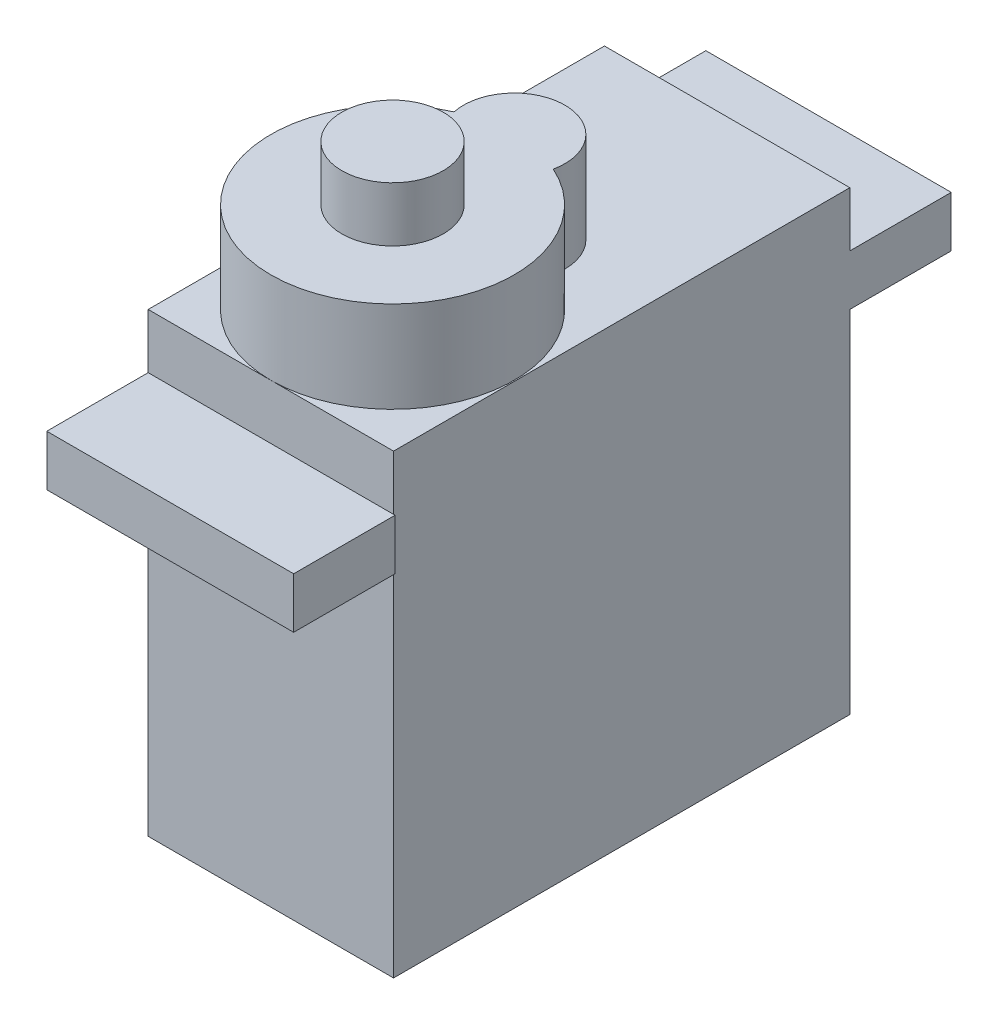
ISO-10303-21;
HEADER;
FILE_DESCRIPTION(('STEP AP214'),'2;1');
FILE_NAME('part.step','',(''),(''),'','','');
FILE_SCHEMA(('AUTOMOTIVE_DESIGN { 1 0 10303 214 1 1 1 1 }'));
ENDSEC;
DATA;
#1=APPLICATION_CONTEXT('core data for automotive mechanical design processes');
#2=APPLICATION_PROTOCOL_DEFINITION('international standard','automotive_design',2000,#1);
#3=PRODUCT_CONTEXT('',#1,'mechanical');
#4=PRODUCT('Part','Part','',(#3));
#5=PRODUCT_RELATED_PRODUCT_CATEGORY('part','',(#4));
#6=PRODUCT_DEFINITION_FORMATION('','',#4);
#7=PRODUCT_DEFINITION_CONTEXT('part definition',#1,'design');
#8=PRODUCT_DEFINITION('design','',#6,#7);
#9=PRODUCT_DEFINITION_SHAPE('','',#8);
#10=(LENGTH_UNIT() NAMED_UNIT(*) SI_UNIT(.MILLI.,.METRE.));
#11=(NAMED_UNIT(*) PLANE_ANGLE_UNIT() SI_UNIT($,.RADIAN.));
#12=(NAMED_UNIT(*) SI_UNIT($,.STERADIAN.) SOLID_ANGLE_UNIT());
#13=UNCERTAINTY_MEASURE_WITH_UNIT(LENGTH_MEASURE(1.E-05),#10,'distance_accuracy_value','');
#14=(GEOMETRIC_REPRESENTATION_CONTEXT(3) GLOBAL_UNCERTAINTY_ASSIGNED_CONTEXT((#13)) GLOBAL_UNIT_ASSIGNED_CONTEXT((#10,
#11,#12)) REPRESENTATION_CONTEXT('',''));
#15=CARTESIAN_POINT('',(0.,0.,0.));
#16=DIRECTION('',(0.,0.,1.));
#17=DIRECTION('',(1.,0.,0.));
#18=AXIS2_PLACEMENT_3D('',#15,#16,#17);
#19=CARTESIAN_POINT('',(6.05,22.5,-11.25));
#20=DIRECTION('',(-1.,0.,0.));
#21=DIRECTION('',(0.,0.,1.));
#22=AXIS2_PLACEMENT_3D('',#19,#20,#21);
#23=PLANE('',#22);
#24=DIRECTION('',(0.,0.,-1.));
#25=VECTOR('',#24,1.);
#26=CARTESIAN_POINT('',(6.05,0.,-11.25));
#27=LINE('',#26,#25);
#28=CARTESIAN_POINT('',(6.05,0.,11.25));
#29=VERTEX_POINT('',#28);
#30=CARTESIAN_POINT('',(6.05,0.,-11.25));
#31=VERTEX_POINT('',#30);
#32=EDGE_CURVE('E199',#29,#31,#27,.T.);
#33=ORIENTED_EDGE('',*,*,#32,.T.);
#34=DIRECTION('',(0.,-1.,0.));
#35=VECTOR('',#34,1.);
#36=CARTESIAN_POINT('',(6.05,17.3,-11.25));
#37=LINE('',#36,#35);
#38=CARTESIAN_POINT('',(6.05,17.3,-11.25));
#39=VERTEX_POINT('',#38);
#40=EDGE_CURVE('E294',#39,#31,#37,.T.);
#41=ORIENTED_EDGE('',*,*,#40,.F.);
#42=DIRECTION('',(0.,0.,1.));
#43=VECTOR('',#42,1.);
#44=CARTESIAN_POINT('',(6.05,17.3,-11.25));
#45=LINE('',#44,#43);
#46=CARTESIAN_POINT('',(6.05,17.3,-16.25));
#47=VERTEX_POINT('',#46);
#48=EDGE_CURVE('E290',#47,#39,#45,.T.);
#49=ORIENTED_EDGE('',*,*,#48,.F.);
#50=DIRECTION('',(0.,-1.,0.));
#51=VECTOR('',#50,1.);
#52=CARTESIAN_POINT('',(6.05,19.8,-16.25));
#53=LINE('',#52,#51);
#54=CARTESIAN_POINT('',(6.05,19.8,-16.25));
#55=VERTEX_POINT('',#54);
#56=EDGE_CURVE('E237',#55,#47,#53,.T.);
#57=ORIENTED_EDGE('',*,*,#56,.F.);
#58=DIRECTION('',(0.,0.,1.));
#59=VECTOR('',#58,1.);
#60=CARTESIAN_POINT('',(6.05,19.8,-11.25));
#61=LINE('',#60,#59);
#62=CARTESIAN_POINT('',(6.05,19.8,-11.25));
#63=VERTEX_POINT('',#62);
#64=EDGE_CURVE('E234',#55,#63,#61,.T.);
#65=ORIENTED_EDGE('',*,*,#64,.T.);
#66=DIRECTION('',(0.,-1.,0.));
#67=VECTOR('',#66,1.);
#68=CARTESIAN_POINT('',(6.05,22.5,-11.25));
#69=LINE('',#68,#67);
#70=CARTESIAN_POINT('',(6.05,22.5,-11.25));
#71=VERTEX_POINT('',#70);
#72=EDGE_CURVE('E43',#71,#63,#69,.T.);
#73=ORIENTED_EDGE('',*,*,#72,.F.);
#74=DIRECTION('',(0.,0.,-1.));
#75=VECTOR('',#74,1.);
#76=CARTESIAN_POINT('',(6.05,22.5,-11.25));
#77=LINE('',#76,#75);
#78=CARTESIAN_POINT('',(6.05,22.5,11.25));
#79=VERTEX_POINT('',#78);
#80=EDGE_CURVE('E200',#79,#71,#77,.T.);
#81=ORIENTED_EDGE('',*,*,#80,.F.);
#82=DIRECTION('',(0.,-1.,0.));
#83=VECTOR('',#82,1.);
#84=CARTESIAN_POINT('',(6.05,22.5,11.25));
#85=LINE('',#84,#83);
#86=CARTESIAN_POINT('',(6.05,19.8,11.25));
#87=VERTEX_POINT('',#86);
#88=EDGE_CURVE('E212',#79,#87,#85,.T.);
#89=ORIENTED_EDGE('',*,*,#88,.T.);
#90=DIRECTION('',(0.,-1.,0.));
#91=VECTOR('',#90,1.);
#92=CARTESIAN_POINT('',(6.05,22.5,11.25));
#93=LINE('',#92,#91);
#94=CARTESIAN_POINT('',(6.05,17.3,11.25));
#95=VERTEX_POINT('',#94);
#96=EDGE_CURVE('E173',#87,#95,#93,.T.);
#97=ORIENTED_EDGE('',*,*,#96,.T.);
#98=DIRECTION('',(0.,-1.,0.));
#99=VECTOR('',#98,1.);
#100=CARTESIAN_POINT('',(6.05,22.5,11.25));
#101=LINE('',#100,#99);
#102=EDGE_CURVE('E285',#95,#29,#101,.T.);
#103=ORIENTED_EDGE('',*,*,#102,.T.);
#104=EDGE_LOOP('',(#33,#41,#49,#57,#65,#73,#81,#89,#97,#103));
#105=FACE_BOUND('',#104,.T.);
#106=ADVANCED_FACE('F35',(#105),#23,.F.);
#107=CARTESIAN_POINT('',(-6.05,22.5,-11.25));
#108=DIRECTION('',(0.,0.,1.));
#109=DIRECTION('',(1.,0.,0.));
#110=AXIS2_PLACEMENT_3D('',#107,#108,#109);
#111=PLANE('',#110);
#112=ORIENTED_EDGE('',*,*,#72,.T.);
#113=DIRECTION('',(-1.,0.,0.));
#114=VECTOR('',#113,1.);
#115=CARTESIAN_POINT('',(-6.05,19.8,-11.25));
#116=LINE('',#115,#114);
#117=CARTESIAN_POINT('',(-6.05,19.8,-11.25));
#118=VERTEX_POINT('',#117);
#119=EDGE_CURVE('E230',#63,#118,#116,.T.);
#120=ORIENTED_EDGE('',*,*,#119,.T.);
#121=DIRECTION('',(0.,-1.,0.));
#122=VECTOR('',#121,1.);
#123=CARTESIAN_POINT('',(-6.05,22.5,-11.25));
#124=LINE('',#123,#122);
#125=CARTESIAN_POINT('',(-6.05,22.5,-11.25));
#126=VERTEX_POINT('',#125);
#127=EDGE_CURVE('E221',#126,#118,#124,.T.);
#128=ORIENTED_EDGE('',*,*,#127,.F.);
#129=DIRECTION('',(-1.,0.,0.));
#130=VECTOR('',#129,1.);
#131=CARTESIAN_POINT('',(-6.05,22.5,-11.25));
#132=LINE('',#131,#130);
#133=EDGE_CURVE('E203',#71,#126,#132,.T.);
#134=ORIENTED_EDGE('',*,*,#133,.F.);
#135=EDGE_LOOP('',(#112,#120,#128,#134));
#136=FACE_BOUND('',#135,.T.);
#137=ADVANCED_FACE('F227',(#136),#111,.F.);
#138=CARTESIAN_POINT('',(-6.05,22.5,-11.25));
#139=DIRECTION('',(1.,0.,0.));
#140=DIRECTION('',(0.,0.,-1.));
#141=AXIS2_PLACEMENT_3D('',#138,#139,#140);
#142=PLANE('',#141);
#143=DIRECTION('',(0.,0.,1.));
#144=VECTOR('',#143,1.);
#145=CARTESIAN_POINT('',(-6.05,0.,-11.25));
#146=LINE('',#145,#144);
#147=CARTESIAN_POINT('',(-6.05,0.,-11.25));
#148=VERTEX_POINT('',#147);
#149=CARTESIAN_POINT('',(-6.05,0.,11.25));
#150=VERTEX_POINT('',#149);
#151=EDGE_CURVE('E204',#148,#150,#146,.T.);
#152=ORIENTED_EDGE('',*,*,#151,.T.);
#153=DIRECTION('',(0.,-1.,0.));
#154=VECTOR('',#153,1.);
#155=CARTESIAN_POINT('',(-6.05,17.3,11.25));
#156=LINE('',#155,#154);
#157=CARTESIAN_POINT('',(-6.05,17.3,11.25));
#158=VERTEX_POINT('',#157);
#159=EDGE_CURVE('E282',#158,#150,#156,.T.);
#160=ORIENTED_EDGE('',*,*,#159,.F.);
#161=DIRECTION('',(0.,0.,-1.));
#162=VECTOR('',#161,1.);
#163=CARTESIAN_POINT('',(-6.05,17.3,11.25));
#164=LINE('',#163,#162);
#165=CARTESIAN_POINT('',(-6.05,17.3,16.25));
#166=VERTEX_POINT('',#165);
#167=EDGE_CURVE('E165',#166,#158,#164,.T.);
#168=ORIENTED_EDGE('',*,*,#167,.F.);
#169=DIRECTION('',(0.,-1.,0.));
#170=VECTOR('',#169,1.);
#171=CARTESIAN_POINT('',(-6.05,19.8,16.25));
#172=LINE('',#171,#170);
#173=CARTESIAN_POINT('',(-6.05,19.8,16.25));
#174=VERTEX_POINT('',#173);
#175=EDGE_CURVE('E164',#174,#166,#172,.T.);
#176=ORIENTED_EDGE('',*,*,#175,.F.);
#177=DIRECTION('',(0.,0.,-1.));
#178=VECTOR('',#177,1.);
#179=CARTESIAN_POINT('',(-6.05,19.8,11.25));
#180=LINE('',#179,#178);
#181=CARTESIAN_POINT('',(-6.05,19.8,11.25));
#182=VERTEX_POINT('',#181);
#183=EDGE_CURVE('E175',#174,#182,#180,.T.);
#184=ORIENTED_EDGE('',*,*,#183,.T.);
#185=DIRECTION('',(0.,-1.,0.));
#186=VECTOR('',#185,1.);
#187=CARTESIAN_POINT('',(-6.05,22.5,11.25));
#188=LINE('',#187,#186);
#189=CARTESIAN_POINT('',(-6.05,22.5,11.25));
#190=VERTEX_POINT('',#189);
#191=EDGE_CURVE('E219',#190,#182,#188,.T.);
#192=ORIENTED_EDGE('',*,*,#191,.F.);
#193=DIRECTION('',(0.,0.,1.));
#194=VECTOR('',#193,1.);
#195=CARTESIAN_POINT('',(-6.05,22.5,-11.25));
#196=LINE('',#195,#194);
#197=EDGE_CURVE('E206',#126,#190,#196,.T.);
#198=ORIENTED_EDGE('',*,*,#197,.F.);
#199=ORIENTED_EDGE('',*,*,#127,.T.);
#200=DIRECTION('',(0.,0.,-1.));
#201=VECTOR('',#200,1.);
#202=CARTESIAN_POINT('',(-6.05,19.8,-16.25));
#203=LINE('',#202,#201);
#204=CARTESIAN_POINT('',(-6.05,19.8,-16.25));
#205=VERTEX_POINT('',#204);
#206=EDGE_CURVE('E245',#118,#205,#203,.T.);
#207=ORIENTED_EDGE('',*,*,#206,.T.);
#208=DIRECTION('',(0.,-1.,0.));
#209=VECTOR('',#208,1.);
#210=CARTESIAN_POINT('',(-6.05,19.8,-16.25));
#211=LINE('',#210,#209);
#212=CARTESIAN_POINT('',(-6.05,17.3,-16.25));
#213=VERTEX_POINT('',#212);
#214=EDGE_CURVE('E246',#205,#213,#211,.T.);
#215=ORIENTED_EDGE('',*,*,#214,.T.);
#216=DIRECTION('',(0.,0.,-1.));
#217=VECTOR('',#216,1.);
#218=CARTESIAN_POINT('',(-6.05,17.3,-16.25));
#219=LINE('',#218,#217);
#220=CARTESIAN_POINT('',(-6.05,17.3,-11.25));
#221=VERTEX_POINT('',#220);
#222=EDGE_CURVE('E60',#221,#213,#219,.T.);
#223=ORIENTED_EDGE('',*,*,#222,.F.);
#224=DIRECTION('',(0.,-1.,0.));
#225=VECTOR('',#224,1.);
#226=CARTESIAN_POINT('',(-6.05,17.3,-11.25));
#227=LINE('',#226,#225);
#228=EDGE_CURVE('E279',#221,#148,#227,.T.);
#229=ORIENTED_EDGE('',*,*,#228,.T.);
#230=EDGE_LOOP('',(#152,#160,#168,#176,#184,#192,#198,#199,#207,#215,#223,#229));
#231=FACE_BOUND('',#230,.T.);
#232=ADVANCED_FACE('F262',(#231),#142,.F.);
#233=CARTESIAN_POINT('',(-6.05,22.5,11.25));
#234=DIRECTION('',(0.,0.,-1.));
#235=DIRECTION('',(-1.,0.,0.));
#236=AXIS2_PLACEMENT_3D('',#233,#234,#235);
#237=PLANE('',#236);
#238=ORIENTED_EDGE('',*,*,#191,.T.);
#239=DIRECTION('',(1.,0.,0.));
#240=VECTOR('',#239,1.);
#241=CARTESIAN_POINT('',(6.125,19.8,11.25));
#242=LINE('',#241,#240);
#243=EDGE_CURVE('E254',#182,#87,#242,.T.);
#244=ORIENTED_EDGE('',*,*,#243,.T.);
#245=ORIENTED_EDGE('',*,*,#88,.F.);
#246=DIRECTION('',(1.,0.,0.));
#247=VECTOR('',#246,1.);
#248=CARTESIAN_POINT('',(-6.05,22.5,11.25));
#249=LINE('',#248,#247);
#250=CARTESIAN_POINT('',(0.,22.5,11.25));
#251=VERTEX_POINT('',#250);
#252=EDGE_CURVE('E208',#251,#79,#249,.T.);
#253=ORIENTED_EDGE('',*,*,#252,.F.);
#254=EDGE_CURVE('E209',#190,#251,#249,.T.);
#255=ORIENTED_EDGE('',*,*,#254,.F.);
#256=EDGE_LOOP('',(#238,#244,#245,#253,#255));
#257=FACE_BOUND('',#256,.T.);
#258=ADVANCED_FACE('F271',(#257),#237,.F.);
#259=CARTESIAN_POINT('',(0.,22.5,0.));
#260=DIRECTION('',(0.,1.,0.));
#261=DIRECTION('',(0.,0.,1.));
#262=AXIS2_PLACEMENT_3D('',#259,#260,#261);
#263=PLANE('',#262);
#264=CARTESIAN_POINT('',(0.,22.5,5.25));
#265=DIRECTION('',(0.,1.,0.));
#266=DIRECTION('',(0.,0.,1.));
#267=AXIS2_PLACEMENT_3D('',#264,#265,#266);
#268=CIRCLE('',#267,6.);
#269=CARTESIAN_POINT('',(-2.44514470714698,22.5,-0.229166666666664));
#270=VERTEX_POINT('',#269);
#271=EDGE_CURVE('E45',#270,#251,#268,.T.);
#272=ORIENTED_EDGE('',*,*,#271,.F.);
#273=CARTESIAN_POINT('',(0.,22.5,-0.749999999999998));
#274=DIRECTION('',(0.,1.,0.));
#275=DIRECTION('',(0.,0.,1.));
#276=AXIS2_PLACEMENT_3D('',#273,#274,#275);
#277=CIRCLE('',#276,2.5);
#278=CARTESIAN_POINT('',(2.44514470714698,22.5,-0.229166666666663));
#279=VERTEX_POINT('',#278);
#280=EDGE_CURVE('E188',#279,#270,#277,.T.);
#281=ORIENTED_EDGE('',*,*,#280,.F.);
#282=EDGE_CURVE('E11',#251,#279,#268,.T.);
#283=ORIENTED_EDGE('',*,*,#282,.F.);
#284=ORIENTED_EDGE('',*,*,#252,.T.);
#285=ORIENTED_EDGE('',*,*,#80,.T.);
#286=ORIENTED_EDGE('',*,*,#133,.T.);
#287=ORIENTED_EDGE('',*,*,#197,.T.);
#288=ORIENTED_EDGE('',*,*,#254,.T.);
#289=EDGE_LOOP('',(#272,#281,#283,#284,#285,#286,#287,#288));
#290=FACE_BOUND('',#289,.T.);
#291=ADVANCED_FACE('F303',(#290),#263,.T.);
#292=CARTESIAN_POINT('',(0.,0.,0.));
#293=DIRECTION('',(0.,1.,0.));
#294=DIRECTION('',(0.,0.,1.));
#295=AXIS2_PLACEMENT_3D('',#292,#293,#294);
#296=PLANE('',#295);
#297=ORIENTED_EDGE('',*,*,#32,.F.);
#298=DIRECTION('',(1.,0.,0.));
#299=VECTOR('',#298,1.);
#300=CARTESIAN_POINT('',(6.125,0.,11.25));
#301=LINE('',#300,#299);
#302=EDGE_CURVE('E277',#150,#29,#301,.T.);
#303=ORIENTED_EDGE('',*,*,#302,.F.);
#304=ORIENTED_EDGE('',*,*,#151,.F.);
#305=DIRECTION('',(-1.,0.,0.));
#306=VECTOR('',#305,1.);
#307=CARTESIAN_POINT('',(-6.05,0.,-11.25));
#308=LINE('',#307,#306);
#309=EDGE_CURVE('E288',#31,#148,#308,.T.);
#310=ORIENTED_EDGE('',*,*,#309,.F.);
#311=EDGE_LOOP('',(#297,#303,#304,#310));
#312=FACE_BOUND('',#311,.T.);
#313=ADVANCED_FACE('F337',(#312),#296,.F.);
#314=CARTESIAN_POINT('',(0.,27.,5.25));
#315=DIRECTION('',(0.,-1.,0.));
#316=DIRECTION('',(0.,0.,-1.));
#317=AXIS2_PLACEMENT_3D('',#314,#315,#316);
#318=CYLINDRICAL_SURFACE('',#317,6.);
#319=ORIENTED_EDGE('',*,*,#271,.T.);
#320=ORIENTED_EDGE('',*,*,#282,.T.);
#321=DIRECTION('',(0.,-1.,0.));
#322=VECTOR('',#321,1.);
#323=CARTESIAN_POINT('',(2.44514470714698,27.,-0.229166666666663));
#324=LINE('',#323,#322);
#325=CARTESIAN_POINT('',(2.44514470714698,27.,-0.229166666666663));
#326=VERTEX_POINT('',#325);
#327=EDGE_CURVE('E196',#326,#279,#324,.T.);
#328=ORIENTED_EDGE('',*,*,#327,.F.);
#329=CARTESIAN_POINT('',(0.,27.,5.25));
#330=DIRECTION('',(0.,1.,0.));
#331=DIRECTION('',(0.,0.,1.));
#332=AXIS2_PLACEMENT_3D('',#329,#330,#331);
#333=CIRCLE('',#332,6.);
#334=CARTESIAN_POINT('',(-2.44514470714698,27.,-0.229166666666664));
#335=VERTEX_POINT('',#334);
#336=EDGE_CURVE('E184',#335,#326,#333,.T.);
#337=ORIENTED_EDGE('',*,*,#336,.F.);
#338=DIRECTION('',(0.,-1.,0.));
#339=VECTOR('',#338,1.);
#340=CARTESIAN_POINT('',(-2.44514470714698,27.,-0.229166666666664));
#341=LINE('',#340,#339);
#342=EDGE_CURVE('E189',#335,#270,#341,.T.);
#343=ORIENTED_EDGE('',*,*,#342,.T.);
#344=EDGE_LOOP('',(#319,#320,#328,#337,#343));
#345=FACE_BOUND('',#344,.T.);
#346=ADVANCED_FACE('F306',(#345),#318,.T.);
#347=CARTESIAN_POINT('',(0.,27.,-0.749999999999998));
#348=DIRECTION('',(0.,-1.,0.));
#349=DIRECTION('',(0.,0.,-1.));
#350=AXIS2_PLACEMENT_3D('',#347,#348,#349);
#351=CYLINDRICAL_SURFACE('',#350,2.5);
#352=ORIENTED_EDGE('',*,*,#280,.T.);
#353=ORIENTED_EDGE('',*,*,#342,.F.);
#354=CARTESIAN_POINT('',(0.,27.,-0.749999999999998));
#355=DIRECTION('',(0.,1.,0.));
#356=DIRECTION('',(0.,0.,1.));
#357=AXIS2_PLACEMENT_3D('',#354,#355,#356);
#358=CIRCLE('',#357,2.5);
#359=EDGE_CURVE('E187',#326,#335,#358,.T.);
#360=ORIENTED_EDGE('',*,*,#359,.F.);
#361=ORIENTED_EDGE('',*,*,#327,.T.);
#362=EDGE_LOOP('',(#352,#353,#360,#361));
#363=FACE_BOUND('',#362,.T.);
#364=ADVANCED_FACE('F309',(#363),#351,.T.);
#365=CARTESIAN_POINT('',(0.,27.,2.25));
#366=DIRECTION('',(0.,1.,0.));
#367=DIRECTION('',(0.,0.,1.));
#368=AXIS2_PLACEMENT_3D('',#365,#366,#367);
#369=PLANE('',#368);
#370=CARTESIAN_POINT('',(0.,27.,5.25));
#371=DIRECTION('',(0.,1.,0.));
#372=DIRECTION('',(0.,0.,1.));
#373=AXIS2_PLACEMENT_3D('',#370,#371,#372);
#374=CIRCLE('',#373,2.5);
#375=CARTESIAN_POINT('',(0.,27.,7.75));
#376=VERTEX_POINT('',#375);
#377=EDGE_CURVE('E38',#376,#376,#374,.F.);
#378=ORIENTED_EDGE('',*,*,#377,.T.);
#379=EDGE_LOOP('',(#378));
#380=FACE_BOUND('',#379,.T.);
#381=ORIENTED_EDGE('',*,*,#336,.T.);
#382=ORIENTED_EDGE('',*,*,#359,.T.);
#383=EDGE_LOOP('',(#381,#382));
#384=FACE_BOUND('',#383,.T.);
#385=ADVANCED_FACE('F312',(#380,#384),#369,.T.);
#386=CARTESIAN_POINT('',(0.,29.7,5.25));
#387=DIRECTION('',(0.,-1.,0.));
#388=DIRECTION('',(0.,0.,-1.));
#389=AXIS2_PLACEMENT_3D('',#386,#387,#388);
#390=CYLINDRICAL_SURFACE('',#389,2.5);
#391=ORIENTED_EDGE('',*,*,#377,.F.);
#392=EDGE_LOOP('',(#391));
#393=FACE_BOUND('',#392,.T.);
#394=CARTESIAN_POINT('',(0.,29.7,5.25));
#395=DIRECTION('',(0.,1.,0.));
#396=DIRECTION('',(0.,0.,1.));
#397=AXIS2_PLACEMENT_3D('',#394,#395,#396);
#398=CIRCLE('',#397,2.5);
#399=CARTESIAN_POINT('',(0.,29.7,7.75));
#400=VERTEX_POINT('',#399);
#401=EDGE_CURVE('E181',#400,#400,#398,.T.);
#402=ORIENTED_EDGE('',*,*,#401,.F.);
#403=EDGE_LOOP('',(#402));
#404=FACE_BOUND('',#403,.T.);
#405=ADVANCED_FACE('F314',(#393,#404),#390,.T.);
#406=CARTESIAN_POINT('',(0.,29.7,5.25));
#407=DIRECTION('',(0.,1.,0.));
#408=DIRECTION('',(0.,0.,1.));
#409=AXIS2_PLACEMENT_3D('',#406,#407,#408);
#410=PLANE('',#409);
#411=ORIENTED_EDGE('',*,*,#401,.T.);
#412=EDGE_LOOP('',(#411));
#413=FACE_BOUND('',#412,.T.);
#414=ADVANCED_FACE('F321',(#413),#410,.T.);
#415=CARTESIAN_POINT('',(6.125,19.8,11.25));
#416=DIRECTION('',(0.,0.,-1.));
#417=DIRECTION('',(-1.,0.,0.));
#418=AXIS2_PLACEMENT_3D('',#415,#416,#417);
#419=PLANE('',#418);
#420=DIRECTION('',(1.,0.,0.));
#421=VECTOR('',#420,1.);
#422=CARTESIAN_POINT('',(6.125,17.3,11.25));
#423=LINE('',#422,#421);
#424=CARTESIAN_POINT('',(6.125,17.3,11.25));
#425=VERTEX_POINT('',#424);
#426=EDGE_CURVE('E52',#95,#425,#423,.T.);
#427=ORIENTED_EDGE('',*,*,#426,.F.);
#428=ORIENTED_EDGE('',*,*,#96,.F.);
#429=CARTESIAN_POINT('',(6.125,19.8,11.25));
#430=VERTEX_POINT('',#429);
#431=EDGE_CURVE('E252',#87,#430,#242,.T.);
#432=ORIENTED_EDGE('',*,*,#431,.T.);
#433=DIRECTION('',(0.,-1.,0.));
#434=VECTOR('',#433,1.);
#435=CARTESIAN_POINT('',(6.125,19.8,11.25));
#436=LINE('',#435,#434);
#437=EDGE_CURVE('E171',#430,#425,#436,.T.);
#438=ORIENTED_EDGE('',*,*,#437,.T.);
#439=EDGE_LOOP('',(#427,#428,#432,#438));
#440=FACE_BOUND('',#439,.T.);
#441=ADVANCED_FACE('F276',(#440),#419,.T.);
#442=CARTESIAN_POINT('',(-6.05,19.8,16.25));
#443=DIRECTION('',(0.,0.,1.));
#444=DIRECTION('',(1.,0.,0.));
#445=AXIS2_PLACEMENT_3D('',#442,#443,#444);
#446=PLANE('',#445);
#447=DIRECTION('',(-1.,0.,0.));
#448=VECTOR('',#447,1.);
#449=CARTESIAN_POINT('',(-6.05,17.3,16.25));
#450=LINE('',#449,#448);
#451=CARTESIAN_POINT('',(6.125,17.3,16.25));
#452=VERTEX_POINT('',#451);
#453=EDGE_CURVE('E150',#452,#166,#450,.T.);
#454=ORIENTED_EDGE('',*,*,#453,.F.);
#455=DIRECTION('',(0.,-1.,0.));
#456=VECTOR('',#455,1.);
#457=CARTESIAN_POINT('',(6.125,19.8,16.25));
#458=LINE('',#457,#456);
#459=CARTESIAN_POINT('',(6.125,19.8,16.25));
#460=VERTEX_POINT('',#459);
#461=EDGE_CURVE('E162',#460,#452,#458,.T.);
#462=ORIENTED_EDGE('',*,*,#461,.F.);
#463=DIRECTION('',(-1.,0.,0.));
#464=VECTOR('',#463,1.);
#465=CARTESIAN_POINT('',(-6.05,19.8,16.25));
#466=LINE('',#465,#464);
#467=EDGE_CURVE('E257',#460,#174,#466,.T.);
#468=ORIENTED_EDGE('',*,*,#467,.T.);
#469=ORIENTED_EDGE('',*,*,#175,.T.);
#470=EDGE_LOOP('',(#454,#462,#468,#469));
#471=FACE_BOUND('',#470,.T.);
#472=ADVANCED_FACE('F160',(#471),#446,.T.);
#473=CARTESIAN_POINT('',(6.125,19.8,16.25));
#474=DIRECTION('',(1.,0.,0.));
#475=DIRECTION('',(0.,0.,-1.));
#476=AXIS2_PLACEMENT_3D('',#473,#474,#475);
#477=PLANE('',#476);
#478=DIRECTION('',(0.,0.,1.));
#479=VECTOR('',#478,1.);
#480=CARTESIAN_POINT('',(6.125,17.3,16.25));
#481=LINE('',#480,#479);
#482=EDGE_CURVE('E146',#425,#452,#481,.T.);
#483=ORIENTED_EDGE('',*,*,#482,.F.);
#484=ORIENTED_EDGE('',*,*,#437,.F.);
#485=DIRECTION('',(0.,0.,1.));
#486=VECTOR('',#485,1.);
#487=CARTESIAN_POINT('',(6.125,19.8,16.25));
#488=LINE('',#487,#486);
#489=EDGE_CURVE('E170',#430,#460,#488,.T.);
#490=ORIENTED_EDGE('',*,*,#489,.T.);
#491=ORIENTED_EDGE('',*,*,#461,.T.);
#492=EDGE_LOOP('',(#483,#484,#490,#491));
#493=FACE_BOUND('',#492,.T.);
#494=ADVANCED_FACE('F168',(#493),#477,.T.);
#495=CARTESIAN_POINT('',(0.,19.8,0.));
#496=DIRECTION('',(0.,1.,0.));
#497=DIRECTION('',(0.,0.,1.));
#498=AXIS2_PLACEMENT_3D('',#495,#496,#497);
#499=PLANE('',#498);
#500=ORIENTED_EDGE('',*,*,#243,.F.);
#501=ORIENTED_EDGE('',*,*,#183,.F.);
#502=ORIENTED_EDGE('',*,*,#467,.F.);
#503=ORIENTED_EDGE('',*,*,#489,.F.);
#504=ORIENTED_EDGE('',*,*,#431,.F.);
#505=EDGE_LOOP('',(#500,#501,#502,#503,#504));
#506=FACE_BOUND('',#505,.T.);
#507=ADVANCED_FACE('F267',(#506),#499,.T.);
#508=CARTESIAN_POINT('',(6.05,19.8,-16.25));
#509=DIRECTION('',(0.,0.,-1.));
#510=DIRECTION('',(-1.,0.,0.));
#511=AXIS2_PLACEMENT_3D('',#508,#509,#510);
#512=PLANE('',#511);
#513=DIRECTION('',(1.,0.,0.));
#514=VECTOR('',#513,1.);
#515=CARTESIAN_POINT('',(6.05,17.3,-16.25));
#516=LINE('',#515,#514);
#517=EDGE_CURVE('E287',#213,#47,#516,.T.);
#518=ORIENTED_EDGE('',*,*,#517,.F.);
#519=ORIENTED_EDGE('',*,*,#214,.F.);
#520=DIRECTION('',(1.,0.,0.));
#521=VECTOR('',#520,1.);
#522=CARTESIAN_POINT('',(6.05,19.8,-16.25));
#523=LINE('',#522,#521);
#524=EDGE_CURVE('E241',#205,#55,#523,.T.);
#525=ORIENTED_EDGE('',*,*,#524,.T.);
#526=ORIENTED_EDGE('',*,*,#56,.T.);
#527=EDGE_LOOP('',(#518,#519,#525,#526));
#528=FACE_BOUND('',#527,.T.);
#529=ADVANCED_FACE('F301',(#528),#512,.T.);
#530=CARTESIAN_POINT('',(0.,19.8,0.));
#531=DIRECTION('',(0.,1.,0.));
#532=DIRECTION('',(0.,0.,1.));
#533=AXIS2_PLACEMENT_3D('',#530,#531,#532);
#534=PLANE('',#533);
#535=ORIENTED_EDGE('',*,*,#206,.F.);
#536=ORIENTED_EDGE('',*,*,#119,.F.);
#537=ORIENTED_EDGE('',*,*,#64,.F.);
#538=ORIENTED_EDGE('',*,*,#524,.F.);
#539=EDGE_LOOP('',(#535,#536,#537,#538));
#540=FACE_BOUND('',#539,.T.);
#541=ADVANCED_FACE('F243',(#540),#534,.T.);
#542=CARTESIAN_POINT('',(-6.05,17.3,-11.25));
#543=DIRECTION('',(0.,0.,1.));
#544=DIRECTION('',(1.,0.,0.));
#545=AXIS2_PLACEMENT_3D('',#542,#543,#544);
#546=PLANE('',#545);
#547=ORIENTED_EDGE('',*,*,#309,.T.);
#548=ORIENTED_EDGE('',*,*,#228,.F.);
#549=DIRECTION('',(-1.,0.,0.));
#550=VECTOR('',#549,1.);
#551=CARTESIAN_POINT('',(-6.05,17.3,-11.25));
#552=LINE('',#551,#550);
#553=EDGE_CURVE('E292',#39,#221,#552,.T.);
#554=ORIENTED_EDGE('',*,*,#553,.F.);
#555=ORIENTED_EDGE('',*,*,#40,.T.);
#556=EDGE_LOOP('',(#547,#548,#554,#555));
#557=FACE_BOUND('',#556,.T.);
#558=ADVANCED_FACE('F407',(#557),#546,.F.);
#559=CARTESIAN_POINT('',(0.,17.3,0.));
#560=DIRECTION('',(0.,1.,0.));
#561=DIRECTION('',(0.,0.,1.));
#562=AXIS2_PLACEMENT_3D('',#559,#560,#561);
#563=PLANE('',#562);
#564=ORIENTED_EDGE('',*,*,#222,.T.);
#565=ORIENTED_EDGE('',*,*,#517,.T.);
#566=ORIENTED_EDGE('',*,*,#48,.T.);
#567=ORIENTED_EDGE('',*,*,#553,.T.);
#568=EDGE_LOOP('',(#564,#565,#566,#567));
#569=FACE_BOUND('',#568,.T.);
#570=ADVANCED_FACE('F459',(#569),#563,.F.);
#571=CARTESIAN_POINT('',(6.125,17.3,11.25));
#572=DIRECTION('',(0.,0.,-1.));
#573=DIRECTION('',(-1.,0.,0.));
#574=AXIS2_PLACEMENT_3D('',#571,#572,#573);
#575=PLANE('',#574);
#576=EDGE_CURVE('E156',#158,#95,#423,.T.);
#577=ORIENTED_EDGE('',*,*,#576,.F.);
#578=ORIENTED_EDGE('',*,*,#159,.T.);
#579=ORIENTED_EDGE('',*,*,#302,.T.);
#580=ORIENTED_EDGE('',*,*,#102,.F.);
#581=EDGE_LOOP('',(#577,#578,#579,#580));
#582=FACE_BOUND('',#581,.T.);
#583=ADVANCED_FACE('F469',(#582),#575,.F.);
#584=CARTESIAN_POINT('',(0.,17.3,0.));
#585=DIRECTION('',(0.,1.,0.));
#586=DIRECTION('',(0.,0.,1.));
#587=AXIS2_PLACEMENT_3D('',#584,#585,#586);
#588=PLANE('',#587);
#589=ORIENTED_EDGE('',*,*,#576,.T.);
#590=ORIENTED_EDGE('',*,*,#426,.T.);
#591=ORIENTED_EDGE('',*,*,#482,.T.);
#592=ORIENTED_EDGE('',*,*,#453,.T.);
#593=ORIENTED_EDGE('',*,*,#167,.T.);
#594=EDGE_LOOP('',(#589,#590,#591,#592,#593));
#595=FACE_BOUND('',#594,.T.);
#596=ADVANCED_FACE('F148',(#595),#588,.F.);
#597=CLOSED_SHELL('',(#106,#137,#232,#258,#291,#313,#346,#364,#385,#405,#414,#441,#472,#494,
#507,#529,#541,#558,#570,#583,#596));
#598=MANIFOLD_SOLID_BREP('B2',#597);
#599=ADVANCED_BREP_SHAPE_REPRESENTATION('',(#18,#598),#14);
#600=SHAPE_DEFINITION_REPRESENTATION(#9,#599);
ENDSEC;
END-ISO-10303-21;
